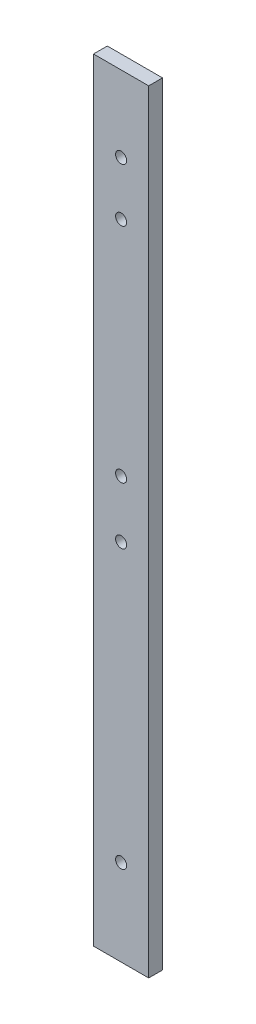
ISO-10303-21;
HEADER;
FILE_DESCRIPTION(('STEP AP214'),'2;1');
FILE_NAME('part.step','',(''),(''),'','','');
FILE_SCHEMA(('AUTOMOTIVE_DESIGN { 1 0 10303 214 1 1 1 1 }'));
ENDSEC;
DATA;
#1=APPLICATION_CONTEXT('core data for automotive mechanical design processes');
#2=APPLICATION_PROTOCOL_DEFINITION('international standard','automotive_design',2000,#1);
#3=PRODUCT_CONTEXT('',#1,'mechanical');
#4=PRODUCT('Part','Part','',(#3));
#5=PRODUCT_RELATED_PRODUCT_CATEGORY('part','',(#4));
#6=PRODUCT_DEFINITION_FORMATION('','',#4);
#7=PRODUCT_DEFINITION_CONTEXT('part definition',#1,'design');
#8=PRODUCT_DEFINITION('design','',#6,#7);
#9=PRODUCT_DEFINITION_SHAPE('','',#8);
#10=(LENGTH_UNIT() NAMED_UNIT(*) SI_UNIT(.MILLI.,.METRE.));
#11=(NAMED_UNIT(*) PLANE_ANGLE_UNIT() SI_UNIT($,.RADIAN.));
#12=(NAMED_UNIT(*) SI_UNIT($,.STERADIAN.) SOLID_ANGLE_UNIT());
#13=UNCERTAINTY_MEASURE_WITH_UNIT(LENGTH_MEASURE(1.E-05),#10,'distance_accuracy_value','');
#14=(GEOMETRIC_REPRESENTATION_CONTEXT(3) GLOBAL_UNCERTAINTY_ASSIGNED_CONTEXT((#13)) GLOBAL_UNIT_ASSIGNED_CONTEXT((#10,
#11,#12)) REPRESENTATION_CONTEXT('',''));
#15=CARTESIAN_POINT('',(0.,0.,0.));
#16=DIRECTION('',(0.,0.,1.));
#17=DIRECTION('',(1.,0.,0.));
#18=AXIS2_PLACEMENT_3D('',#15,#16,#17);
#19=CARTESIAN_POINT('',(-12.7,-177.8,6.35));
#20=DIRECTION('',(1.,0.,0.));
#21=DIRECTION('',(0.,0.,-1.));
#22=AXIS2_PLACEMENT_3D('',#19,#20,#21);
#23=PLANE('',#22);
#24=DIRECTION('',(0.,-1.,0.));
#25=VECTOR('',#24,1.);
#26=CARTESIAN_POINT('',(-12.7,-177.8,0.));
#27=LINE('',#26,#25);
#28=CARTESIAN_POINT('',(-12.7,177.8,0.));
#29=VERTEX_POINT('',#28);
#30=CARTESIAN_POINT('',(-12.7,-177.8,0.));
#31=VERTEX_POINT('',#30);
#32=EDGE_CURVE('E96',#29,#31,#27,.T.);
#33=ORIENTED_EDGE('',*,*,#32,.T.);
#34=DIRECTION('',(0.,0.,-1.));
#35=VECTOR('',#34,1.);
#36=CARTESIAN_POINT('',(-12.7,-177.8,6.35));
#37=LINE('',#36,#35);
#38=CARTESIAN_POINT('',(-12.7,-177.8,6.35));
#39=VERTEX_POINT('',#38);
#40=EDGE_CURVE('E11',#39,#31,#37,.T.);
#41=ORIENTED_EDGE('',*,*,#40,.F.);
#42=DIRECTION('',(0.,-1.,0.));
#43=VECTOR('',#42,1.);
#44=CARTESIAN_POINT('',(-12.7,-177.8,6.35));
#45=LINE('',#44,#43);
#46=CARTESIAN_POINT('',(-12.7,177.8,6.35));
#47=VERTEX_POINT('',#46);
#48=EDGE_CURVE('E84',#47,#39,#45,.T.);
#49=ORIENTED_EDGE('',*,*,#48,.F.);
#50=DIRECTION('',(0.,0.,-1.));
#51=VECTOR('',#50,1.);
#52=CARTESIAN_POINT('',(-12.7,177.8,6.35));
#53=LINE('',#52,#51);
#54=EDGE_CURVE('E92',#47,#29,#53,.T.);
#55=ORIENTED_EDGE('',*,*,#54,.T.);
#56=EDGE_LOOP('',(#33,#41,#49,#55));
#57=FACE_BOUND('',#56,.T.);
#58=ADVANCED_FACE('F33',(#57),#23,.F.);
#59=CARTESIAN_POINT('',(12.7,-177.8,6.35));
#60=DIRECTION('',(0.,1.,0.));
#61=DIRECTION('',(-1.,0.,0.));
#62=AXIS2_PLACEMENT_3D('',#59,#60,#61);
#63=PLANE('',#62);
#64=DIRECTION('',(1.,0.,0.));
#65=VECTOR('',#64,1.);
#66=CARTESIAN_POINT('',(12.7,-177.8,0.));
#67=LINE('',#66,#65);
#68=CARTESIAN_POINT('',(12.7,-177.8,0.));
#69=VERTEX_POINT('',#68);
#70=EDGE_CURVE('E88',#31,#69,#67,.T.);
#71=ORIENTED_EDGE('',*,*,#70,.T.);
#72=DIRECTION('',(0.,0.,-1.));
#73=VECTOR('',#72,1.);
#74=CARTESIAN_POINT('',(12.7,-177.8,6.35));
#75=LINE('',#74,#73);
#76=CARTESIAN_POINT('',(12.7,-177.8,6.35));
#77=VERTEX_POINT('',#76);
#78=EDGE_CURVE('E41',#77,#69,#75,.T.);
#79=ORIENTED_EDGE('',*,*,#78,.F.);
#80=DIRECTION('',(1.,0.,0.));
#81=VECTOR('',#80,1.);
#82=CARTESIAN_POINT('',(12.7,-177.8,6.35));
#83=LINE('',#82,#81);
#84=EDGE_CURVE('E79',#39,#77,#83,.T.);
#85=ORIENTED_EDGE('',*,*,#84,.F.);
#86=ORIENTED_EDGE('',*,*,#40,.T.);
#87=EDGE_LOOP('',(#71,#79,#85,#86));
#88=FACE_BOUND('',#87,.T.);
#89=ADVANCED_FACE('F87',(#88),#63,.F.);
#90=CARTESIAN_POINT('',(12.7,-177.8,6.35));
#91=DIRECTION('',(-1.,0.,0.));
#92=DIRECTION('',(0.,0.,1.));
#93=AXIS2_PLACEMENT_3D('',#90,#91,#92);
#94=PLANE('',#93);
#95=DIRECTION('',(0.,1.,0.));
#96=VECTOR('',#95,1.);
#97=CARTESIAN_POINT('',(12.7,-177.8,0.));
#98=LINE('',#97,#96);
#99=CARTESIAN_POINT('',(12.7,177.8,0.));
#100=VERTEX_POINT('',#99);
#101=EDGE_CURVE('E66',#69,#100,#98,.T.);
#102=ORIENTED_EDGE('',*,*,#101,.T.);
#103=DIRECTION('',(0.,0.,-1.));
#104=VECTOR('',#103,1.);
#105=CARTESIAN_POINT('',(12.7,177.8,6.35));
#106=LINE('',#105,#104);
#107=CARTESIAN_POINT('',(12.7,177.8,6.35));
#108=VERTEX_POINT('',#107);
#109=EDGE_CURVE('E89',#108,#100,#106,.T.);
#110=ORIENTED_EDGE('',*,*,#109,.F.);
#111=DIRECTION('',(0.,1.,0.));
#112=VECTOR('',#111,1.);
#113=CARTESIAN_POINT('',(12.7,-177.8,6.35));
#114=LINE('',#113,#112);
#115=EDGE_CURVE('E82',#77,#108,#114,.T.);
#116=ORIENTED_EDGE('',*,*,#115,.F.);
#117=ORIENTED_EDGE('',*,*,#78,.T.);
#118=EDGE_LOOP('',(#102,#110,#116,#117));
#119=FACE_BOUND('',#118,.T.);
#120=ADVANCED_FACE('F90',(#119),#94,.F.);
#121=CARTESIAN_POINT('',(12.7,177.8,6.35));
#122=DIRECTION('',(0.,-1.,0.));
#123=DIRECTION('',(1.,0.,0.));
#124=AXIS2_PLACEMENT_3D('',#121,#122,#123);
#125=PLANE('',#124);
#126=DIRECTION('',(-1.,0.,0.));
#127=VECTOR('',#126,1.);
#128=CARTESIAN_POINT('',(12.7,177.8,0.));
#129=LINE('',#128,#127);
#130=EDGE_CURVE('E72',#100,#29,#129,.T.);
#131=ORIENTED_EDGE('',*,*,#130,.T.);
#132=ORIENTED_EDGE('',*,*,#54,.F.);
#133=DIRECTION('',(-1.,0.,0.));
#134=VECTOR('',#133,1.);
#135=CARTESIAN_POINT('',(12.7,177.8,6.35));
#136=LINE('',#135,#134);
#137=EDGE_CURVE('E49',#108,#47,#136,.T.);
#138=ORIENTED_EDGE('',*,*,#137,.F.);
#139=ORIENTED_EDGE('',*,*,#109,.T.);
#140=EDGE_LOOP('',(#131,#132,#138,#139));
#141=FACE_BOUND('',#140,.T.);
#142=ADVANCED_FACE('F104',(#141),#125,.F.);
#143=CARTESIAN_POINT('',(0.,0.,6.35));
#144=DIRECTION('',(0.,0.,1.));
#145=DIRECTION('',(1.,0.,0.));
#146=AXIS2_PLACEMENT_3D('',#143,#144,#145);
#147=PLANE('',#146);
#148=CARTESIAN_POINT('',(0.,-138.1125,6.35));
#149=DIRECTION('',(0.,0.,1.));
#150=DIRECTION('',(1.,0.,0.));
#151=AXIS2_PLACEMENT_3D('',#148,#149,#150);
#152=CIRCLE('',#151,2.54);
#153=CARTESIAN_POINT('',(2.54000000000004,-138.1125,6.35));
#154=VERTEX_POINT('',#153);
#155=EDGE_CURVE('E134',#154,#154,#152,.T.);
#156=ORIENTED_EDGE('',*,*,#155,.F.);
#157=EDGE_LOOP('',(#156));
#158=FACE_BOUND('',#157,.T.);
#159=CARTESIAN_POINT('',(0.,-10.3187500000003,6.35));
#160=DIRECTION('',(0.,0.,1.));
#161=DIRECTION('',(1.,0.,0.));
#162=AXIS2_PLACEMENT_3D('',#159,#160,#161);
#163=CIRCLE('',#162,2.54);
#164=CARTESIAN_POINT('',(2.54000000000002,-10.3187500000003,6.35));
#165=VERTEX_POINT('',#164);
#166=EDGE_CURVE('E128',#165,#165,#163,.T.);
#167=ORIENTED_EDGE('',*,*,#166,.F.);
#168=EDGE_LOOP('',(#167));
#169=FACE_BOUND('',#168,.T.);
#170=CARTESIAN_POINT('',(0.,15.8749999999998,6.35));
#171=DIRECTION('',(0.,0.,1.));
#172=DIRECTION('',(1.,0.,0.));
#173=AXIS2_PLACEMENT_3D('',#170,#171,#172);
#174=CIRCLE('',#173,2.54);
#175=CARTESIAN_POINT('',(2.54000000000002,15.8749999999998,6.35));
#176=VERTEX_POINT('',#175);
#177=EDGE_CURVE('E122',#176,#176,#174,.T.);
#178=ORIENTED_EDGE('',*,*,#177,.F.);
#179=EDGE_LOOP('',(#178));
#180=FACE_BOUND('',#179,.T.);
#181=CARTESIAN_POINT('',(0.,118.26875,6.35));
#182=DIRECTION('',(0.,0.,1.));
#183=DIRECTION('',(1.,0.,0.));
#184=AXIS2_PLACEMENT_3D('',#181,#182,#183);
#185=CIRCLE('',#184,2.54);
#186=CARTESIAN_POINT('',(2.54000000000001,118.26875,6.35));
#187=VERTEX_POINT('',#186);
#188=EDGE_CURVE('E116',#187,#187,#185,.T.);
#189=ORIENTED_EDGE('',*,*,#188,.F.);
#190=EDGE_LOOP('',(#189));
#191=FACE_BOUND('',#190,.T.);
#192=CARTESIAN_POINT('',(0.,142.875,6.35));
#193=DIRECTION('',(0.,0.,1.));
#194=DIRECTION('',(1.,0.,0.));
#195=AXIS2_PLACEMENT_3D('',#192,#193,#194);
#196=CIRCLE('',#195,2.54);
#197=CARTESIAN_POINT('',(2.54000000000001,142.875,6.35));
#198=VERTEX_POINT('',#197);
#199=EDGE_CURVE('E110',#198,#198,#196,.T.);
#200=ORIENTED_EDGE('',*,*,#199,.F.);
#201=EDGE_LOOP('',(#200));
#202=FACE_BOUND('',#201,.T.);
#203=ORIENTED_EDGE('',*,*,#48,.T.);
#204=ORIENTED_EDGE('',*,*,#84,.T.);
#205=ORIENTED_EDGE('',*,*,#115,.T.);
#206=ORIENTED_EDGE('',*,*,#137,.T.);
#207=EDGE_LOOP('',(#203,#204,#205,#206));
#208=FACE_BOUND('',#207,.T.);
#209=ADVANCED_FACE('F80',(#158,#169,#180,#191,#202,#208),#147,.T.);
#210=CARTESIAN_POINT('',(0.,0.,0.));
#211=DIRECTION('',(0.,0.,1.));
#212=DIRECTION('',(1.,0.,0.));
#213=AXIS2_PLACEMENT_3D('',#210,#211,#212);
#214=PLANE('',#213);
#215=CARTESIAN_POINT('',(0.,-138.1125,0.));
#216=DIRECTION('',(0.,0.,1.));
#217=DIRECTION('',(1.,0.,0.));
#218=AXIS2_PLACEMENT_3D('',#215,#216,#217);
#219=CIRCLE('',#218,2.54);
#220=CARTESIAN_POINT('',(2.54000000000004,-138.1125,0.));
#221=VERTEX_POINT('',#220);
#222=EDGE_CURVE('E131',#221,#221,#219,.T.);
#223=ORIENTED_EDGE('',*,*,#222,.T.);
#224=EDGE_LOOP('',(#223));
#225=FACE_BOUND('',#224,.T.);
#226=CARTESIAN_POINT('',(0.,-10.3187500000003,0.));
#227=DIRECTION('',(0.,0.,1.));
#228=DIRECTION('',(1.,0.,0.));
#229=AXIS2_PLACEMENT_3D('',#226,#227,#228);
#230=CIRCLE('',#229,2.54);
#231=CARTESIAN_POINT('',(2.54000000000002,-10.3187500000003,0.));
#232=VERTEX_POINT('',#231);
#233=EDGE_CURVE('E125',#232,#232,#230,.T.);
#234=ORIENTED_EDGE('',*,*,#233,.T.);
#235=EDGE_LOOP('',(#234));
#236=FACE_BOUND('',#235,.T.);
#237=CARTESIAN_POINT('',(0.,15.8749999999998,0.));
#238=DIRECTION('',(0.,0.,1.));
#239=DIRECTION('',(1.,0.,0.));
#240=AXIS2_PLACEMENT_3D('',#237,#238,#239);
#241=CIRCLE('',#240,2.54);
#242=CARTESIAN_POINT('',(2.54000000000002,15.8749999999998,0.));
#243=VERTEX_POINT('',#242);
#244=EDGE_CURVE('E119',#243,#243,#241,.T.);
#245=ORIENTED_EDGE('',*,*,#244,.T.);
#246=EDGE_LOOP('',(#245));
#247=FACE_BOUND('',#246,.T.);
#248=CARTESIAN_POINT('',(0.,118.26875,0.));
#249=DIRECTION('',(0.,0.,1.));
#250=DIRECTION('',(1.,0.,0.));
#251=AXIS2_PLACEMENT_3D('',#248,#249,#250);
#252=CIRCLE('',#251,2.54);
#253=CARTESIAN_POINT('',(2.54000000000001,118.26875,0.));
#254=VERTEX_POINT('',#253);
#255=EDGE_CURVE('E113',#254,#254,#252,.T.);
#256=ORIENTED_EDGE('',*,*,#255,.T.);
#257=EDGE_LOOP('',(#256));
#258=FACE_BOUND('',#257,.T.);
#259=CARTESIAN_POINT('',(0.,142.875,0.));
#260=DIRECTION('',(0.,0.,1.));
#261=DIRECTION('',(1.,0.,0.));
#262=AXIS2_PLACEMENT_3D('',#259,#260,#261);
#263=CIRCLE('',#262,2.54);
#264=CARTESIAN_POINT('',(2.54000000000001,142.875,0.));
#265=VERTEX_POINT('',#264);
#266=EDGE_CURVE('E99',#265,#265,#263,.T.);
#267=ORIENTED_EDGE('',*,*,#266,.T.);
#268=EDGE_LOOP('',(#267));
#269=FACE_BOUND('',#268,.T.);
#270=ORIENTED_EDGE('',*,*,#32,.F.);
#271=ORIENTED_EDGE('',*,*,#130,.F.);
#272=ORIENTED_EDGE('',*,*,#101,.F.);
#273=ORIENTED_EDGE('',*,*,#70,.F.);
#274=EDGE_LOOP('',(#270,#271,#272,#273));
#275=FACE_BOUND('',#274,.T.);
#276=ADVANCED_FACE('F107',(#225,#236,#247,#258,#269,#275),#214,.F.);
#277=CARTESIAN_POINT('',(0.,142.875,0.));
#278=DIRECTION('',(0.,0.,1.));
#279=DIRECTION('',(1.,0.,0.));
#280=AXIS2_PLACEMENT_3D('',#277,#278,#279);
#281=CYLINDRICAL_SURFACE('',#280,2.54);
#282=ORIENTED_EDGE('',*,*,#266,.F.);
#283=EDGE_LOOP('',(#282));
#284=FACE_BOUND('',#283,.T.);
#285=ORIENTED_EDGE('',*,*,#199,.T.);
#286=EDGE_LOOP('',(#285));
#287=FACE_BOUND('',#286,.T.);
#288=ADVANCED_FACE('F160',(#284,#287),#281,.F.);
#289=CARTESIAN_POINT('',(0.,118.26875,0.));
#290=DIRECTION('',(0.,0.,1.));
#291=DIRECTION('',(1.,0.,0.));
#292=AXIS2_PLACEMENT_3D('',#289,#290,#291);
#293=CYLINDRICAL_SURFACE('',#292,2.54);
#294=ORIENTED_EDGE('',*,*,#255,.F.);
#295=EDGE_LOOP('',(#294));
#296=FACE_BOUND('',#295,.T.);
#297=ORIENTED_EDGE('',*,*,#188,.T.);
#298=EDGE_LOOP('',(#297));
#299=FACE_BOUND('',#298,.T.);
#300=ADVANCED_FACE('F162',(#296,#299),#293,.F.);
#301=CARTESIAN_POINT('',(0.,15.8749999999998,0.));
#302=DIRECTION('',(0.,0.,1.));
#303=DIRECTION('',(1.,0.,0.));
#304=AXIS2_PLACEMENT_3D('',#301,#302,#303);
#305=CYLINDRICAL_SURFACE('',#304,2.54);
#306=ORIENTED_EDGE('',*,*,#244,.F.);
#307=EDGE_LOOP('',(#306));
#308=FACE_BOUND('',#307,.T.);
#309=ORIENTED_EDGE('',*,*,#177,.T.);
#310=EDGE_LOOP('',(#309));
#311=FACE_BOUND('',#310,.T.);
#312=ADVANCED_FACE('F169',(#308,#311),#305,.F.);
#313=CARTESIAN_POINT('',(0.,-10.3187500000003,0.));
#314=DIRECTION('',(0.,0.,1.));
#315=DIRECTION('',(1.,0.,0.));
#316=AXIS2_PLACEMENT_3D('',#313,#314,#315);
#317=CYLINDRICAL_SURFACE('',#316,2.54);
#318=ORIENTED_EDGE('',*,*,#233,.F.);
#319=EDGE_LOOP('',(#318));
#320=FACE_BOUND('',#319,.T.);
#321=ORIENTED_EDGE('',*,*,#166,.T.);
#322=EDGE_LOOP('',(#321));
#323=FACE_BOUND('',#322,.T.);
#324=ADVANCED_FACE('F145',(#320,#323),#317,.F.);
#325=CARTESIAN_POINT('',(0.,-138.1125,0.));
#326=DIRECTION('',(0.,0.,1.));
#327=DIRECTION('',(1.,0.,0.));
#328=AXIS2_PLACEMENT_3D('',#325,#326,#327);
#329=CYLINDRICAL_SURFACE('',#328,2.54);
#330=ORIENTED_EDGE('',*,*,#222,.F.);
#331=EDGE_LOOP('',(#330));
#332=FACE_BOUND('',#331,.T.);
#333=ORIENTED_EDGE('',*,*,#155,.T.);
#334=EDGE_LOOP('',(#333));
#335=FACE_BOUND('',#334,.T.);
#336=ADVANCED_FACE('F142',(#332,#335),#329,.F.);
#337=CLOSED_SHELL('',(#58,#89,#120,#142,#209,#276,#288,#300,#312,#324,#336));
#338=MANIFOLD_SOLID_BREP('B2',#337);
#339=ADVANCED_BREP_SHAPE_REPRESENTATION('',(#18,#338),#14);
#340=SHAPE_DEFINITION_REPRESENTATION(#9,#339);
ENDSEC;
END-ISO-10303-21;
